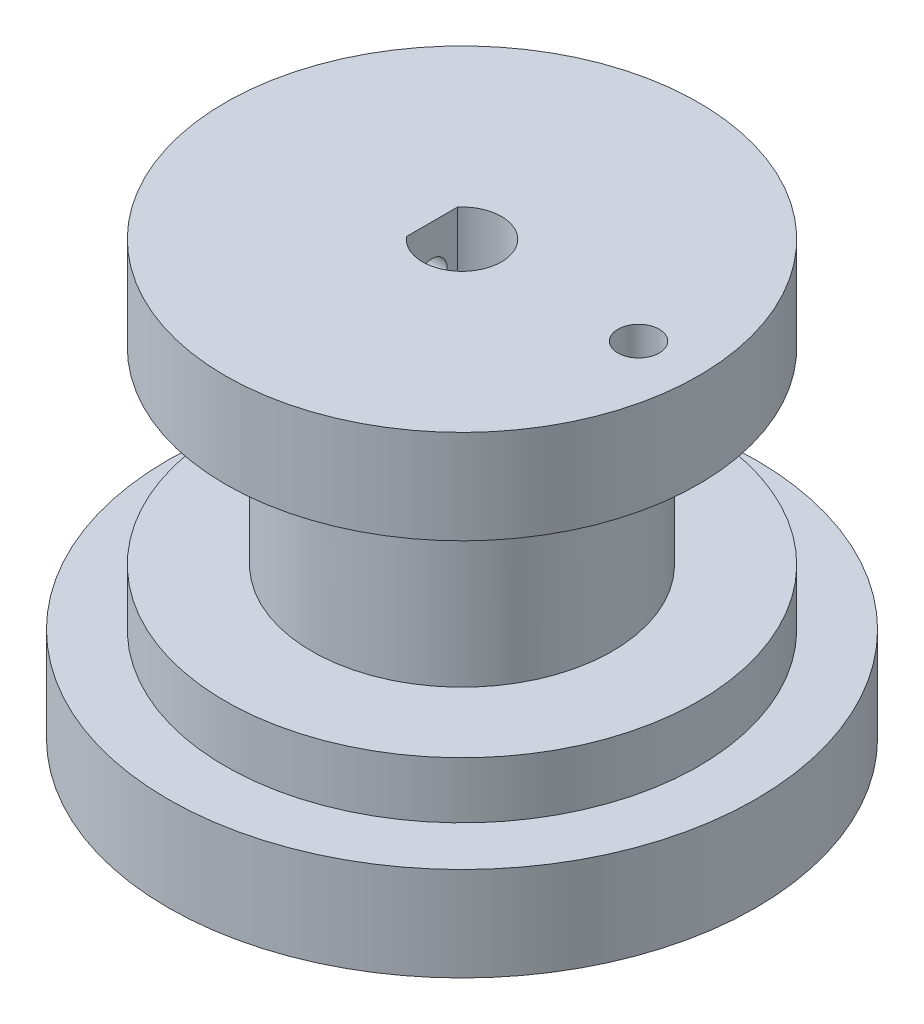
ISO-10303-21;
HEADER;
FILE_DESCRIPTION(('STEP AP214'),'2;1');
FILE_NAME('part.step','',(''),(''),'','','');
FILE_SCHEMA(('AUTOMOTIVE_DESIGN { 1 0 10303 214 1 1 1 1 }'));
ENDSEC;
DATA;
#1=APPLICATION_CONTEXT('core data for automotive mechanical design processes');
#2=APPLICATION_PROTOCOL_DEFINITION('international standard','automotive_design',2000,#1);
#3=PRODUCT_CONTEXT('',#1,'mechanical');
#4=PRODUCT('Part','Part','',(#3));
#5=PRODUCT_RELATED_PRODUCT_CATEGORY('part','',(#4));
#6=PRODUCT_DEFINITION_FORMATION('','',#4);
#7=PRODUCT_DEFINITION_CONTEXT('part definition',#1,'design');
#8=PRODUCT_DEFINITION('design','',#6,#7);
#9=PRODUCT_DEFINITION_SHAPE('','',#8);
#10=(LENGTH_UNIT() NAMED_UNIT(*) SI_UNIT(.MILLI.,.METRE.));
#11=(NAMED_UNIT(*) PLANE_ANGLE_UNIT() SI_UNIT($,.RADIAN.));
#12=(NAMED_UNIT(*) SI_UNIT($,.STERADIAN.) SOLID_ANGLE_UNIT());
#13=UNCERTAINTY_MEASURE_WITH_UNIT(LENGTH_MEASURE(1.E-05),#10,'distance_accuracy_value','');
#14=(GEOMETRIC_REPRESENTATION_CONTEXT(3) GLOBAL_UNCERTAINTY_ASSIGNED_CONTEXT((#13)) GLOBAL_UNIT_ASSIGNED_CONTEXT((#10,
#11,#12)) REPRESENTATION_CONTEXT('',''));
#15=CARTESIAN_POINT('',(0.,0.,0.));
#16=DIRECTION('',(0.,0.,1.));
#17=DIRECTION('',(1.,0.,0.));
#18=AXIS2_PLACEMENT_3D('',#15,#16,#17);
#19=CARTESIAN_POINT('',(0.,-3.,0.));
#20=DIRECTION('',(0.,1.,0.));
#21=DIRECTION('',(0.,0.,1.));
#22=AXIS2_PLACEMENT_3D('',#19,#20,#21);
#23=CYLINDRICAL_SURFACE('',#22,2.1);
#24=CARTESIAN_POINT('',(1.94164878389476,12.5,0.799999999999996));
#25=CARTESIAN_POINT('',(1.94164699833232,12.4568528835088,0.800001879676993));
#26=CARTESIAN_POINT('',(1.943102585536,12.4137179114915,0.796497800571623));
#27=CARTESIAN_POINT('',(1.94872498911232,12.3287517724577,0.782640615272448));
#28=CARTESIAN_POINT('',(1.95289165787973,12.2869205345892,0.772287881954125));
#29=CARTESIAN_POINT('',(1.96339719673269,12.2058138710265,0.745171053432956));
#30=CARTESIAN_POINT('',(1.96973070797949,12.1665324218897,0.728422763384062));
#31=CARTESIAN_POINT('',(1.98384753765178,12.0913214029018,0.689046479794834));
#32=CARTESIAN_POINT('',(1.99163130579252,12.0553928779717,0.666416661568793));
#33=CARTESIAN_POINT('',(2.00821915402083,11.98606332986,0.614675716816078));
#34=CARTESIAN_POINT('',(2.01705390186838,11.9528585916092,0.585311344720344));
#35=CARTESIAN_POINT('',(2.03449287955212,11.891705853021,0.521471686232205));
#36=CARTESIAN_POINT('',(2.043097057807,11.8637590206614,0.486995267296852));
#37=CARTESIAN_POINT('',(2.05947144728356,11.8129612964966,0.412411896008606));
#38=CARTESIAN_POINT('',(2.06720153272778,11.7903249447949,0.372149223837869));
#39=CARTESIAN_POINT('',(2.08058697282075,11.7522288348971,0.288040534021781));
#40=CARTESIAN_POINT('',(2.08624307172665,11.7367665017505,0.2441958087286));
#41=CARTESIAN_POINT('',(2.09462544941136,11.7141493159712,0.156232019338102));
#42=CARTESIAN_POINT('',(2.09747059791007,11.7066562760945,0.112211459631675));
#43=CARTESIAN_POINT('',(2.10033781339492,11.6991055179366,0.0234518871629957));
#44=CARTESIAN_POINT('',(2.10036082775177,11.6990453045075,-0.0212868794582319));
#45=CARTESIAN_POINT('',(2.09765602702878,11.7061676612724,-0.107784143640846));
#46=CARTESIAN_POINT('',(2.09506852951834,11.7129807819771,-0.149578220316622));
#47=CARTESIAN_POINT('',(2.08761866536252,11.7330333204045,-0.231378247119249));
#48=CARTESIAN_POINT('',(2.08275613708709,11.7462731947199,-0.27138406997795));
#49=CARTESIAN_POINT('',(2.07114701454641,11.7789687169565,-0.349171310099706));
#50=CARTESIAN_POINT('',(2.06437377475487,11.7985128774184,-0.386911382765753));
#51=CARTESIAN_POINT('',(2.04962556202786,11.8431828332164,-0.458670936332288));
#52=CARTESIAN_POINT('',(2.04165019517148,11.8683104594639,-0.492689191313412));
#53=CARTESIAN_POINT('',(2.02475018723996,11.9252010489249,-0.558211333544711));
#54=CARTESIAN_POINT('',(2.01579730286622,11.9572723829803,-0.589440595999129));
#55=CARTESIAN_POINT('',(1.99833198884494,12.0262464467357,-0.646183145581933));
#56=CARTESIAN_POINT('',(1.98981967768813,12.063150466847,-0.671694901085843));
#57=CARTESIAN_POINT('',(1.97401796644548,12.1418592672077,-0.716826447599144));
#58=CARTESIAN_POINT('',(1.96676207728876,12.1837589746452,-0.736293375791852));
#59=CARTESIAN_POINT('',(1.95468325573982,12.2705914131839,-0.767789901155166));
#60=CARTESIAN_POINT('',(1.94985891756766,12.3155223747148,-0.779823796578322));
#61=CARTESIAN_POINT('',(1.94352325966061,12.4044214134719,-0.795477889021222));
#62=CARTESIAN_POINT('',(1.94183987737875,12.4483000497857,-0.799535752001992));
#63=CARTESIAN_POINT('',(1.94148888784802,12.5361339678134,-0.800388527707571));
#64=CARTESIAN_POINT('',(1.94282049167064,12.58008922647,-0.797185340424152));
#65=CARTESIAN_POINT('',(1.94817424966198,12.6645415589041,-0.784004187720394));
#66=CARTESIAN_POINT('',(1.95205964461256,12.7051020114608,-0.77437021196188));
#67=CARTESIAN_POINT('',(1.96191925706139,12.7840102881224,-0.749036877022603));
#68=CARTESIAN_POINT('',(1.96789391075156,12.8223576482323,-0.733336251184918));
#69=CARTESIAN_POINT('',(1.98153961091593,12.8973834280495,-0.695640759693074));
#70=CARTESIAN_POINT('',(1.98926680183781,12.9339419109723,-0.6734281156417));
#71=CARTESIAN_POINT('',(2.00545463530356,13.0029675627987,-0.623568661115858));
#72=CARTESIAN_POINT('',(2.01391555295258,13.0354331858236,-0.595919807409689));
#73=CARTESIAN_POINT('',(2.03129012235739,13.0975684524615,-0.533821318323035));
#74=CARTESIAN_POINT('',(2.04019693420108,13.1269135873142,-0.499043915025411));
#75=CARTESIAN_POINT('',(2.05692848722272,13.179392930666,-0.424840970167738));
#76=CARTESIAN_POINT('',(2.0647532163384,13.2025270699321,-0.385415376802109));
#77=CARTESIAN_POINT('',(2.07843990921626,13.2417891255059,-0.303025433897907));
#78=CARTESIAN_POINT('',(2.08430729454874,13.2579364319007,-0.260071276845807));
#79=CARTESIAN_POINT('',(2.09343177638947,13.2826815423713,-0.171780850262254));
#80=CARTESIAN_POINT('',(2.09669014383056,13.2912830224466,-0.126445752043481));
#81=CARTESIAN_POINT('',(2.10010547292817,13.3002865217048,-0.0376087457697565));
#82=CARTESIAN_POINT('',(2.1004366010832,13.3011490467982,0.00584019692997421));
#83=CARTESIAN_POINT('',(2.09841807377082,13.2958420553929,0.092238443322026));
#84=CARTESIAN_POINT('',(2.09606875934191,13.2896734334825,0.135187809874213));
#85=CARTESIAN_POINT('',(2.08903465293787,13.2708042777742,0.218238969958015));
#86=CARTESIAN_POINT('',(2.08441171856163,13.2582764806828,0.258385651936228));
#87=CARTESIAN_POINT('',(2.07331554914458,13.2272187338003,0.336008130101743));
#88=CARTESIAN_POINT('',(2.06684196367384,13.2086876471681,0.373483418766886));
#89=CARTESIAN_POINT('',(2.05234621584812,13.1652526467488,0.446450252468192));
#90=CARTESIAN_POINT('',(2.04426980905919,13.1401107691015,0.481789161589949));
#91=CARTESIAN_POINT('',(2.02755618362467,13.0845389416988,0.547887043256404));
#92=CARTESIAN_POINT('',(2.01891876305954,13.0541070812979,0.578644353531804));
#93=CARTESIAN_POINT('',(2.00147403800879,12.9868353116251,0.636445947730195));
#94=CARTESIAN_POINT('',(1.99268342203299,12.9497353938726,0.663193848854155));
#95=CARTESIAN_POINT('',(1.97645805353686,12.8712908244736,0.71009270130017));
#96=CARTESIAN_POINT('',(1.96902352688579,12.829945467499,0.73024255409963));
#97=CARTESIAN_POINT('',(1.95610827755072,12.7416006329311,0.764194394637584));
#98=CARTESIAN_POINT('',(1.95076481041695,12.6944126359728,0.777563737293924));
#99=CARTESIAN_POINT('',(1.94353732698568,12.5981435966703,0.795462281613972));
#100=CARTESIAN_POINT('',(1.9416508143141,12.5490639465191,0.79999786256002));
#101=CARTESIAN_POINT('',(1.94164878389476,12.5,0.799999999999996));
#102=B_SPLINE_CURVE_WITH_KNOTS('',3,(#24,#25,#26,#27,#28,#29,#30,#31,#32,#33,#34,#35,#36,#37,
#38,#39,#40,#41,#42,#43,#44,#45,#46,#47,#48,#49,#50,#51,#52,#53,#54,#55,#56,#57,#58,#59,#60,#61,
#62,#63,#64,#65,#66,#67,#68,#69,#70,#71,#72,#73,#74,#75,#76,#77,#78,#79,#80,#81,#82,#83,#84,#85,
#86,#87,#88,#89,#90,#91,#92,#93,#94,#95,#96,#97,#98,#99,#100,#101),.UNSPECIFIED.,.T.,.F.,(4,2,2,
2,2,2,2,2,2,2,2,2,2,2,2,2,2,2,2,2,2,2,2,2,2,2,2,2,2,2,2,2,2,2,2,2,2,2,4),(0.,0.129258500703974,
0.258509964498515,0.387444058659251,0.516418201189574,0.651413121766207,0.786437994457466,
0.92622598112136,1.06596375518199,1.19950086087028,1.33299313896266,1.4596731762274,
1.58636221486972,1.71491361875927,1.8435072391664,1.97984173526445,2.11621270955457,
2.25579441609692,2.39529533186353,2.52690045746935,2.6584711500687,2.78351444646914,
2.90858386480088,3.03843705875382,3.1683391524232,3.30678823146984,3.4452388537221,
3.58330273965311,3.72129932943452,3.85102568084781,3.9807355287376,4.10709683087302,
4.2334820760112,4.36525425649951,4.49707412997096,4.6361278430188,4.77520469564702,
4.92229487240554,5.06927878886189),.UNSPECIFIED.);
#103=CARTESIAN_POINT('',(1.94164878389476,12.5,0.799999999999996));
#104=VERTEX_POINT('',#103);
#105=EDGE_CURVE('E74',#104,#104,#102,.T.);
#106=ORIENTED_EDGE('',*,*,#105,.T.);
#107=EDGE_LOOP('',(#106));
#108=FACE_BOUND('',#107,.T.);
#109=DIRECTION('',(0.,1.,0.));
#110=VECTOR('',#109,1.);
#111=CARTESIAN_POINT('',(-1.6,-3.,1.36014705087355));
#112=LINE('',#111,#110);
#113=CARTESIAN_POINT('',(-1.6,15.,1.36014705087355));
#114=VERTEX_POINT('',#113);
#115=CARTESIAN_POINT('',(-1.6,7.,1.36014705087355));
#116=VERTEX_POINT('',#115);
#117=EDGE_CURVE('E11',#114,#116,#112,.F.);
#118=ORIENTED_EDGE('',*,*,#117,.F.);
#119=CARTESIAN_POINT('',(0.,15.,0.));
#120=DIRECTION('',(0.,1.,0.));
#121=DIRECTION('',(0.,0.,1.));
#122=AXIS2_PLACEMENT_3D('',#119,#120,#121);
#123=CIRCLE('',#122,2.1);
#124=CARTESIAN_POINT('',(-1.6,15.,-1.36014705087354));
#125=VERTEX_POINT('',#124);
#126=EDGE_CURVE('E158',#114,#125,#123,.T.);
#127=ORIENTED_EDGE('',*,*,#126,.T.);
#128=DIRECTION('',(0.,1.,0.));
#129=VECTOR('',#128,1.);
#130=CARTESIAN_POINT('',(-1.6,-3.,-1.36014705087354));
#131=LINE('',#130,#129);
#132=CARTESIAN_POINT('',(-1.6,7.,-1.36014705087354));
#133=VERTEX_POINT('',#132);
#134=EDGE_CURVE('E44',#133,#125,#131,.T.);
#135=ORIENTED_EDGE('',*,*,#134,.F.);
#136=CARTESIAN_POINT('',(0.,7.,0.));
#137=DIRECTION('',(0.,-1.,0.));
#138=DIRECTION('',(0.,0.,-1.));
#139=AXIS2_PLACEMENT_3D('',#136,#137,#138);
#140=CIRCLE('',#139,2.1);
#141=EDGE_CURVE('E52',#133,#116,#140,.F.);
#142=ORIENTED_EDGE('',*,*,#141,.T.);
#143=EDGE_LOOP('',(#118,#127,#135,#142));
#144=FACE_BOUND('',#143,.T.);
#145=CARTESIAN_POINT('',(0.,-8.,0.));
#146=DIRECTION('',(0.,-1.,0.));
#147=DIRECTION('',(0.,0.,-1.));
#148=AXIS2_PLACEMENT_3D('',#145,#146,#147);
#149=CIRCLE('',#148,2.1);
#150=CARTESIAN_POINT('',(0.,-8.,-2.1));
#151=VERTEX_POINT('',#150);
#152=EDGE_CURVE('E308',#151,#151,#149,.T.);
#153=ORIENTED_EDGE('',*,*,#152,.T.);
#154=EDGE_LOOP('',(#153));
#155=FACE_BOUND('',#154,.T.);
#156=ADVANCED_FACE('F35',(#108,#144,#155),#23,.F.);
#157=CARTESIAN_POINT('',(0.,10.,0.));
#158=DIRECTION('',(0.,-1.,0.));
#159=DIRECTION('',(0.,0.,-1.));
#160=AXIS2_PLACEMENT_3D('',#157,#158,#159);
#161=CYLINDRICAL_SURFACE('',#160,8.);
#162=CARTESIAN_POINT('',(0.,10.,0.));
#163=DIRECTION('',(0.,1.,0.));
#164=DIRECTION('',(0.,0.,1.));
#165=AXIS2_PLACEMENT_3D('',#162,#163,#164);
#166=CIRCLE('',#165,8.);
#167=CARTESIAN_POINT('',(0.,10.,8.));
#168=VERTEX_POINT('',#167);
#169=EDGE_CURVE('E140',#168,#168,#166,.T.);
#170=ORIENTED_EDGE('',*,*,#169,.F.);
#171=EDGE_LOOP('',(#170));
#172=FACE_BOUND('',#171,.T.);
#173=CARTESIAN_POINT('',(0.,0.,0.));
#174=DIRECTION('',(0.,-1.,0.));
#175=DIRECTION('',(0.,0.,-1.));
#176=AXIS2_PLACEMENT_3D('',#173,#174,#175);
#177=CIRCLE('',#176,8.);
#178=CARTESIAN_POINT('',(0.,0.,-8.));
#179=VERTEX_POINT('',#178);
#180=EDGE_CURVE('E142',#179,#179,#177,.T.);
#181=ORIENTED_EDGE('',*,*,#180,.F.);
#182=EDGE_LOOP('',(#181));
#183=FACE_BOUND('',#182,.T.);
#184=ADVANCED_FACE('F37',(#172,#183),#161,.T.);
#185=CARTESIAN_POINT('',(0.,0.,0.));
#186=DIRECTION('',(0.,-1.,0.));
#187=DIRECTION('',(0.,0.,-1.));
#188=AXIS2_PLACEMENT_3D('',#185,#186,#187);
#189=PLANE('',#188);
#190=CARTESIAN_POINT('',(-9.4,0.,0.));
#191=DIRECTION('',(0.,1.,0.));
#192=DIRECTION('',(0.,0.,1.));
#193=AXIS2_PLACEMENT_3D('',#190,#191,#192);
#194=CIRCLE('',#193,1.1);
#195=CARTESIAN_POINT('',(-9.4,0.,1.1));
#196=VERTEX_POINT('',#195);
#197=EDGE_CURVE('E315',#196,#196,#194,.T.);
#198=ORIENTED_EDGE('',*,*,#197,.F.);
#199=EDGE_LOOP('',(#198));
#200=FACE_BOUND('',#199,.T.);
#201=CARTESIAN_POINT('',(0.,0.,0.));
#202=DIRECTION('',(0.,-1.,0.));
#203=DIRECTION('',(0.,0.,-1.));
#204=AXIS2_PLACEMENT_3D('',#201,#202,#203);
#205=CIRCLE('',#204,12.6);
#206=CARTESIAN_POINT('',(0.,0.,-12.6));
#207=VERTEX_POINT('',#206);
#208=EDGE_CURVE('E166',#207,#207,#205,.T.);
#209=ORIENTED_EDGE('',*,*,#208,.F.);
#210=EDGE_LOOP('',(#209));
#211=FACE_BOUND('',#210,.T.);
#212=ORIENTED_EDGE('',*,*,#180,.T.);
#213=EDGE_LOOP('',(#212));
#214=FACE_BOUND('',#213,.T.);
#215=ADVANCED_FACE('F128',(#200,#211,#214),#189,.F.);
#216=CARTESIAN_POINT('',(0.,-3.,0.));
#217=DIRECTION('',(0.,1.,0.));
#218=DIRECTION('',(0.,0.,1.));
#219=AXIS2_PLACEMENT_3D('',#216,#217,#218);
#220=CYLINDRICAL_SURFACE('',#219,12.6);
#221=CARTESIAN_POINT('',(0.,-3.,0.));
#222=DIRECTION('',(0.,-1.,0.));
#223=DIRECTION('',(0.,0.,-1.));
#224=AXIS2_PLACEMENT_3D('',#221,#222,#223);
#225=CIRCLE('',#224,12.6);
#226=CARTESIAN_POINT('',(0.,-3.,-12.6));
#227=VERTEX_POINT('',#226);
#228=EDGE_CURVE('E146',#227,#227,#225,.T.);
#229=ORIENTED_EDGE('',*,*,#228,.F.);
#230=EDGE_LOOP('',(#229));
#231=FACE_BOUND('',#230,.T.);
#232=ORIENTED_EDGE('',*,*,#208,.T.);
#233=EDGE_LOOP('',(#232));
#234=FACE_BOUND('',#233,.T.);
#235=ADVANCED_FACE('F121',(#231,#234),#220,.T.);
#236=CARTESIAN_POINT('',(0.,10.,0.));
#237=DIRECTION('',(0.,1.,0.));
#238=DIRECTION('',(0.,0.,1.));
#239=AXIS2_PLACEMENT_3D('',#236,#237,#238);
#240=PLANE('',#239);
#241=CARTESIAN_POINT('',(9.4,10.,0.));
#242=DIRECTION('',(0.,-1.,0.));
#243=DIRECTION('',(0.,0.,-1.));
#244=AXIS2_PLACEMENT_3D('',#241,#242,#243);
#245=CIRCLE('',#244,1.1);
#246=CARTESIAN_POINT('',(9.4,10.,-1.1));
#247=VERTEX_POINT('',#246);
#248=EDGE_CURVE('E133',#247,#247,#245,.T.);
#249=ORIENTED_EDGE('',*,*,#248,.F.);
#250=EDGE_LOOP('',(#249));
#251=FACE_BOUND('',#250,.T.);
#252=CARTESIAN_POINT('',(0.,10.,0.));
#253=DIRECTION('',(0.,1.,0.));
#254=DIRECTION('',(0.,0.,1.));
#255=AXIS2_PLACEMENT_3D('',#252,#253,#254);
#256=CIRCLE('',#255,12.6);
#257=CARTESIAN_POINT('',(0.,10.,12.6));
#258=VERTEX_POINT('',#257);
#259=EDGE_CURVE('E137',#258,#258,#256,.T.);
#260=ORIENTED_EDGE('',*,*,#259,.F.);
#261=EDGE_LOOP('',(#260));
#262=FACE_BOUND('',#261,.T.);
#263=ORIENTED_EDGE('',*,*,#169,.T.);
#264=EDGE_LOOP('',(#263));
#265=FACE_BOUND('',#264,.T.);
#266=ADVANCED_FACE('F119',(#251,#262,#265),#240,.F.);
#267=CARTESIAN_POINT('',(0.,15.,0.));
#268=DIRECTION('',(0.,-1.,0.));
#269=DIRECTION('',(0.,0.,-1.));
#270=AXIS2_PLACEMENT_3D('',#267,#268,#269);
#271=CYLINDRICAL_SURFACE('',#270,12.6);
#272=CARTESIAN_POINT('',(-12.5745775276945,12.5,0.799999999999996));
#273=CARTESIAN_POINT('',(-12.5745778676616,12.455112266047,0.799998025396599));
#274=CARTESIAN_POINT('',(-12.5748204675907,12.4101931374248,0.796209350013812));
#275=CARTESIAN_POINT('',(-12.5757647630131,12.3215953129864,0.781150016896046));
#276=CARTESIAN_POINT('',(-12.5764669922779,12.2779181210532,0.76987065994321));
#277=CARTESIAN_POINT('',(-12.5782506859119,12.1931003390021,0.740155343764789));
#278=CARTESIAN_POINT('',(-12.5793319494619,12.1519584191977,0.721723173673076));
#279=CARTESIAN_POINT('',(-12.5817516243511,12.0733631913841,0.678231608778452));
#280=CARTESIAN_POINT('',(-12.5830899769504,12.0359090437424,0.653173727329384));
#281=CARTESIAN_POINT('',(-12.5858753704345,11.9656838918634,0.597099577675161));
#282=CARTESIAN_POINT('',(-12.5873225571524,11.9329193484085,0.566075224799364));
#283=CARTESIAN_POINT('',(-12.5901611982671,11.8730587704134,0.498965500842068));
#284=CARTESIAN_POINT('',(-12.591552650333,11.8459629727621,0.46287991836399));
#285=CARTESIAN_POINT('',(-12.5941242968862,11.7981892136247,0.386635653965054));
#286=CARTESIAN_POINT('',(-12.5953043153204,11.7775165900635,0.34647362091643));
#287=CARTESIAN_POINT('',(-12.5973185987744,11.743210179145,0.263240007490224));
#288=CARTESIAN_POINT('',(-12.5981528675916,11.7295763144815,0.220168459073481));
#289=CARTESIAN_POINT('',(-12.5993806435381,11.7097523421854,0.132400628992771));
#290=CARTESIAN_POINT('',(-12.5997747491017,11.7035521271143,0.087706638782187));
#291=CARTESIAN_POINT('',(-12.6000798075576,11.6987402410679,-0.00208933193220635));
#292=CARTESIAN_POINT('',(-12.5999907660417,11.7001284822661,-0.0471913077080854));
#293=CARTESIAN_POINT('',(-12.5993400627321,11.7104457661604,-0.136454504443628));
#294=CARTESIAN_POINT('',(-12.5987790823929,11.7193639361088,-0.180616987761234));
#295=CARTESIAN_POINT('',(-12.5972484408361,11.7444710496239,-0.266816860915179));
#296=CARTESIAN_POINT('',(-12.5962787771407,11.7606600372704,-0.30885423786623));
#297=CARTESIAN_POINT('',(-12.5940387699117,11.7998615437176,-0.389645498911937));
#298=CARTESIAN_POINT('',(-12.5927682094952,11.8228789874271,-0.428396987087632));
#299=CARTESIAN_POINT('',(-12.5900693917045,11.8750804420153,-0.501490292437836));
#300=CARTESIAN_POINT('',(-12.5886411324972,11.9042645245826,-0.535832058340821));
#301=CARTESIAN_POINT('',(-12.5857846725911,11.968032229688,-0.599194547401847));
#302=CARTESIAN_POINT('',(-12.5843564764433,12.0026252898575,-0.628205773624091));
#303=CARTESIAN_POINT('',(-12.5816636769654,12.0761959219618,-0.680010431827407));
#304=CARTESIAN_POINT('',(-12.5803990737025,12.1151734957018,-0.702803861248721));
#305=CARTESIAN_POINT('',(-12.5781762724374,12.1964127862675,-0.741525240040239));
#306=CARTESIAN_POINT('',(-12.577218092459,12.2386746960968,-0.757452785577085));
#307=CARTESIAN_POINT('',(-12.5757168322069,12.3252802128082,-0.781983695260393));
#308=CARTESIAN_POINT('',(-12.5751737468929,12.3696237944068,-0.790587148338802));
#309=CARTESIAN_POINT('',(-12.5745648660774,12.4590510512592,-0.800213812688113));
#310=CARTESIAN_POINT('',(-12.5744982392562,12.5041332998287,-0.801250226917022));
#311=CARTESIAN_POINT('',(-12.5748476171867,12.5938309979455,-0.79574789342056));
#312=CARTESIAN_POINT('',(-12.5752636193456,12.6384464499993,-0.789209186391174));
#313=CARTESIAN_POINT('',(-12.5765306156057,12.7259067257624,-0.768753189475533));
#314=CARTESIAN_POINT('',(-12.5773812510153,12.768752978082,-0.75484198356948));
#315=CARTESIAN_POINT('',(-12.579421350218,12.8515027069879,-0.720042040731856));
#316=CARTESIAN_POINT('',(-12.5806108171821,12.8914061560285,-0.699153238497632));
#317=CARTESIAN_POINT('',(-12.5831965544337,12.9671982025928,-0.65095733446248));
#318=CARTESIAN_POINT('',(-12.5845931087147,13.0030811659912,-0.62364138799277));
#319=CARTESIAN_POINT('',(-12.5874346502637,13.0697568913388,-0.563379463865039));
#320=CARTESIAN_POINT('',(-12.5888796380205,13.1005496018946,-0.530433429370034));
#321=CARTESIAN_POINT('',(-12.5916576501868,13.1562153447493,-0.459789713623408));
#322=CARTESIAN_POINT('',(-12.5929905112032,13.1810798318281,-0.422085291622804));
#323=CARTESIAN_POINT('',(-12.5953917344913,13.2241248345849,-0.343028977941923));
#324=CARTESIAN_POINT('',(-12.5964600984366,13.2423053925584,-0.301677109344544));
#325=CARTESIAN_POINT('',(-12.5982111683517,13.2714516022804,-0.216531113038256));
#326=CARTESIAN_POINT('',(-12.5988941630815,13.2824226571809,-0.172738841050264));
#327=CARTESIAN_POINT('',(-12.5997986886995,13.296856114379,-0.0839293527350103));
#328=CARTESIAN_POINT('',(-12.6000202243002,13.3003185933539,-0.038912148921453));
#329=CARTESIAN_POINT('',(-12.5999768839911,13.2996358616783,0.0509847613316326));
#330=CARTESIAN_POINT('',(-12.5997128629791,13.2955040220101,0.0958645703428007));
#331=CARTESIAN_POINT('',(-12.5987297954377,13.2797776700802,0.184291797718513));
#332=CARTESIAN_POINT('',(-12.5980107481143,13.2681831447957,0.227839213757826));
#333=CARTESIAN_POINT('',(-12.596198442469,13.2378635805416,0.312367469929137));
#334=CARTESIAN_POINT('',(-12.5951051873938,13.2191386034347,0.353348332324548));
#335=CARTESIAN_POINT('',(-12.5926671955715,13.1750915121255,0.431586304996333));
#336=CARTESIAN_POINT('',(-12.591322465242,13.1497695662699,0.468843510262366));
#337=CARTESIAN_POINT('',(-12.588529958599,13.093197883508,0.538644417474442));
#338=CARTESIAN_POINT('',(-12.5870820165115,13.0619384696982,0.571180269680287));
#339=CARTESIAN_POINT('',(-12.5842476043713,12.9943923883311,0.630553943173488));
#340=CARTESIAN_POINT('',(-12.5828611494427,12.9581044928627,0.657390368644782));
#341=CARTESIAN_POINT('',(-12.5803047290693,12.8814888785224,0.704623939700161));
#342=CARTESIAN_POINT('',(-12.5791350400515,12.8411561010765,0.725012886322638));
#343=CARTESIAN_POINT('',(-12.5771481234325,12.7576615664971,0.758704542604477));
#344=CARTESIAN_POINT('',(-12.5763304835414,12.7145031871158,0.77201554566784));
#345=CARTESIAN_POINT('',(-12.5753543624983,12.6425676178873,0.78771665517149));
#346=CARTESIAN_POINT('',(-12.5750643527478,12.6142553316013,0.792316946178813));
#347=CARTESIAN_POINT('',(-12.5746758269669,12.5572996282038,0.798459246679965));
#348=CARTESIAN_POINT('',(-12.5745773106604,12.5286562115696,0.800001260581623));
#349=CARTESIAN_POINT('',(-12.5745775276945,12.5,0.799999999999996));
#350=B_SPLINE_CURVE_WITH_KNOTS('',3,(#272,#273,#274,#275,#276,#277,#278,#279,#280,#281,#282,
#283,#284,#285,#286,#287,#288,#289,#290,#291,#292,#293,#294,#295,#296,#297,#298,#299,#300,#301,
#302,#303,#304,#305,#306,#307,#308,#309,#310,#311,#312,#313,#314,#315,#316,#317,#318,#319,#320,
#321,#322,#323,#324,#325,#326,#327,#328,#329,#330,#331,#332,#333,#334,#335,#336,#337,#338,#339,
#340,#341,#342,#343,#344,#345,#346,#347,#348,#349),.UNSPECIFIED.,.T.,.F.,(4,2,2,2,2,2,2,2,2,2,2,
2,2,2,2,2,2,2,2,2,2,2,2,2,2,2,2,2,2,2,2,2,2,2,2,2,2,2,4),(0.,0.134558588160676,
0.269273718317808,0.403917581637043,0.538530717982756,0.673327559234391,0.808130032335182,
0.943044234108146,1.07795695409815,1.21268602619238,1.34741353897719,1.48194684566302,
1.61648096797521,1.75111235763197,1.88574531249652,2.02061585279325,2.15548644861373,
2.29036497608837,2.42524186579268,2.55988336613857,2.69452414315043,2.82905398366353,
2.96358508326373,3.0983024109998,3.23302109881745,3.36793281807798,3.50284368360975,
3.63765332471821,3.77246158915005,3.90703272993845,4.04160410556096,4.17617431369056,
4.3107410880876,4.44552909149577,4.58035006714226,4.71534180531025,4.85017501976685,
4.93607699317385,5.02197884277209),.UNSPECIFIED.);
#351=CARTESIAN_POINT('',(-12.5745775276945,12.5,0.799999999999996));
#352=VERTEX_POINT('',#351);
#353=EDGE_CURVE('E78',#352,#352,#350,.T.);
#354=ORIENTED_EDGE('',*,*,#353,.T.);
#355=EDGE_LOOP('',(#354));
#356=FACE_BOUND('',#355,.T.);
#357=CARTESIAN_POINT('',(0.,15.,0.));
#358=DIRECTION('',(0.,1.,0.));
#359=DIRECTION('',(0.,0.,1.));
#360=AXIS2_PLACEMENT_3D('',#357,#358,#359);
#361=CIRCLE('',#360,12.6);
#362=CARTESIAN_POINT('',(0.,15.,12.6));
#363=VERTEX_POINT('',#362);
#364=EDGE_CURVE('E163',#363,#363,#361,.T.);
#365=ORIENTED_EDGE('',*,*,#364,.F.);
#366=EDGE_LOOP('',(#365));
#367=FACE_BOUND('',#366,.T.);
#368=ORIENTED_EDGE('',*,*,#259,.T.);
#369=EDGE_LOOP('',(#368));
#370=FACE_BOUND('',#369,.T.);
#371=ADVANCED_FACE('F92',(#356,#367,#370),#271,.T.);
#372=CARTESIAN_POINT('',(0.,15.,0.));
#373=DIRECTION('',(0.,1.,0.));
#374=DIRECTION('',(0.,0.,1.));
#375=AXIS2_PLACEMENT_3D('',#372,#373,#374);
#376=PLANE('',#375);
#377=CARTESIAN_POINT('',(9.4,15.,0.));
#378=DIRECTION('',(0.,1.,0.));
#379=DIRECTION('',(0.,0.,1.));
#380=AXIS2_PLACEMENT_3D('',#377,#378,#379);
#381=CIRCLE('',#380,1.1);
#382=CARTESIAN_POINT('',(9.4,15.,1.1));
#383=VERTEX_POINT('',#382);
#384=EDGE_CURVE('E39',#383,#383,#381,.T.);
#385=ORIENTED_EDGE('',*,*,#384,.F.);
#386=EDGE_LOOP('',(#385));
#387=FACE_BOUND('',#386,.T.);
#388=DIRECTION('',(0.,0.,1.));
#389=VECTOR('',#388,1.);
#390=CARTESIAN_POINT('',(-1.6,15.,-2.44685641523823));
#391=LINE('',#390,#389);
#392=EDGE_CURVE('E153',#125,#114,#391,.T.);
#393=ORIENTED_EDGE('',*,*,#392,.F.);
#394=ORIENTED_EDGE('',*,*,#126,.F.);
#395=EDGE_LOOP('',(#393,#394));
#396=FACE_BOUND('',#395,.T.);
#397=ORIENTED_EDGE('',*,*,#364,.T.);
#398=EDGE_LOOP('',(#397));
#399=FACE_BOUND('',#398,.T.);
#400=ADVANCED_FACE('F116',(#387,#396,#399),#376,.T.);
#401=CARTESIAN_POINT('',(-1.6,7.,-2.44685641523823));
#402=DIRECTION('',(-1.,0.,0.));
#403=DIRECTION('',(0.,0.,1.));
#404=AXIS2_PLACEMENT_3D('',#401,#402,#403);
#405=PLANE('',#404);
#406=CARTESIAN_POINT('',(-1.6,12.5,0.));
#407=DIRECTION('',(-1.,0.,0.));
#408=DIRECTION('',(0.,0.,1.));
#409=AXIS2_PLACEMENT_3D('',#406,#407,#408);
#410=CIRCLE('',#409,0.799999999999996);
#411=CARTESIAN_POINT('',(-1.6,12.5,0.799999999999996));
#412=VERTEX_POINT('',#411);
#413=EDGE_CURVE('E90',#412,#412,#410,.T.);
#414=ORIENTED_EDGE('',*,*,#413,.T.);
#415=EDGE_LOOP('',(#414));
#416=FACE_BOUND('',#415,.T.);
#417=ORIENTED_EDGE('',*,*,#392,.T.);
#418=ORIENTED_EDGE('',*,*,#117,.T.);
#419=DIRECTION('',(0.,0.,1.));
#420=VECTOR('',#419,1.);
#421=CARTESIAN_POINT('',(-1.6,7.,-2.44685641523823));
#422=LINE('',#421,#420);
#423=EDGE_CURVE('E155',#133,#116,#422,.T.);
#424=ORIENTED_EDGE('',*,*,#423,.F.);
#425=ORIENTED_EDGE('',*,*,#134,.T.);
#426=EDGE_LOOP('',(#417,#418,#424,#425));
#427=FACE_BOUND('',#426,.T.);
#428=ADVANCED_FACE('F115',(#416,#427),#405,.F.);
#429=CARTESIAN_POINT('',(0.,7.,0.));
#430=DIRECTION('',(0.,-1.,0.));
#431=DIRECTION('',(0.,0.,-1.));
#432=AXIS2_PLACEMENT_3D('',#429,#430,#431);
#433=PLANE('',#432);
#434=ORIENTED_EDGE('',*,*,#141,.F.);
#435=ORIENTED_EDGE('',*,*,#423,.T.);
#436=EDGE_LOOP('',(#434,#435));
#437=FACE_BOUND('',#436,.T.);
#438=ADVANCED_FACE('F68',(#437),#433,.T.);
#439=CARTESIAN_POINT('',(3.4,12.5,0.));
#440=DIRECTION('',(-1.,0.,0.));
#441=DIRECTION('',(0.,0.,1.));
#442=AXIS2_PLACEMENT_3D('',#439,#440,#441);
#443=CONICAL_SURFACE('',#442,0.799999999999995,1.02974425867665);
#444=CARTESIAN_POINT('',(3.88068849522205,12.5,0.));
#445=VERTEX_POINT('',#444);
#446=VERTEX_LOOP('',#445);
#447=FACE_BOUND('',#446,.T.);
#448=CARTESIAN_POINT('',(3.4,12.5,0.));
#449=DIRECTION('',(-1.,0.,0.));
#450=DIRECTION('',(0.,0.,1.));
#451=AXIS2_PLACEMENT_3D('',#448,#449,#450);
#452=CIRCLE('',#451,0.799999999999995);
#453=CARTESIAN_POINT('',(3.4,12.5,0.799999999999995));
#454=VERTEX_POINT('',#453);
#455=EDGE_CURVE('E72',#454,#454,#452,.T.);
#456=ORIENTED_EDGE('',*,*,#455,.T.);
#457=EDGE_LOOP('',(#456));
#458=FACE_BOUND('',#457,.T.);
#459=ADVANCED_FACE('F64',(#447,#458),#443,.F.);
#460=CARTESIAN_POINT('',(-12.6,12.5,0.));
#461=DIRECTION('',(-1.,0.,0.));
#462=DIRECTION('',(0.,0.,1.));
#463=AXIS2_PLACEMENT_3D('',#460,#461,#462);
#464=CYLINDRICAL_SURFACE('',#463,0.799999999999996);
#465=ORIENTED_EDGE('',*,*,#455,.F.);
#466=EDGE_LOOP('',(#465));
#467=FACE_BOUND('',#466,.T.);
#468=ORIENTED_EDGE('',*,*,#105,.F.);
#469=EDGE_LOOP('',(#468));
#470=FACE_BOUND('',#469,.T.);
#471=ADVANCED_FACE('F67',(#467,#470),#464,.F.);
#472=ORIENTED_EDGE('',*,*,#353,.F.);
#473=EDGE_LOOP('',(#472));
#474=FACE_BOUND('',#473,.T.);
#475=ORIENTED_EDGE('',*,*,#413,.F.);
#476=EDGE_LOOP('',(#475));
#477=FACE_BOUND('',#476,.T.);
#478=ADVANCED_FACE('F96',(#474,#477),#464,.F.);
#479=CARTESIAN_POINT('',(0.,-8.,0.));
#480=DIRECTION('',(0.,-1.,0.));
#481=DIRECTION('',(0.,0.,-1.));
#482=AXIS2_PLACEMENT_3D('',#479,#480,#481);
#483=PLANE('',#482);
#484=CARTESIAN_POINT('',(-9.4,-8.,0.));
#485=DIRECTION('',(0.,1.,0.));
#486=DIRECTION('',(0.,0.,1.));
#487=AXIS2_PLACEMENT_3D('',#484,#485,#486);
#488=CIRCLE('',#487,1.1);
#489=CARTESIAN_POINT('',(-9.4,-8.,1.1));
#490=VERTEX_POINT('',#489);
#491=EDGE_CURVE('E304',#490,#490,#488,.T.);
#492=ORIENTED_EDGE('',*,*,#491,.T.);
#493=EDGE_LOOP('',(#492));
#494=FACE_BOUND('',#493,.T.);
#495=ORIENTED_EDGE('',*,*,#152,.F.);
#496=EDGE_LOOP('',(#495));
#497=FACE_BOUND('',#496,.T.);
#498=CARTESIAN_POINT('',(0.,-8.,0.));
#499=DIRECTION('',(0.,-1.,0.));
#500=DIRECTION('',(0.,0.,-1.));
#501=AXIS2_PLACEMENT_3D('',#498,#499,#500);
#502=CIRCLE('',#501,15.6440140000327);
#503=CARTESIAN_POINT('',(0.,-8.,-15.6440140000327));
#504=VERTEX_POINT('',#503);
#505=EDGE_CURVE('E75',#504,#504,#502,.T.);
#506=ORIENTED_EDGE('',*,*,#505,.T.);
#507=EDGE_LOOP('',(#506));
#508=FACE_BOUND('',#507,.T.);
#509=ADVANCED_FACE('F100',(#494,#497,#508),#483,.T.);
#510=CARTESIAN_POINT('',(0.,-8.,0.));
#511=DIRECTION('',(0.,1.,0.));
#512=DIRECTION('',(0.,0.,1.));
#513=AXIS2_PLACEMENT_3D('',#510,#511,#512);
#514=CYLINDRICAL_SURFACE('',#513,15.6440140000327);
#515=ORIENTED_EDGE('',*,*,#505,.F.);
#516=EDGE_LOOP('',(#515));
#517=FACE_BOUND('',#516,.T.);
#518=CARTESIAN_POINT('',(0.,-3.,0.));
#519=DIRECTION('',(0.,-1.,0.));
#520=DIRECTION('',(0.,0.,-1.));
#521=AXIS2_PLACEMENT_3D('',#518,#519,#520);
#522=CIRCLE('',#521,15.6440140000327);
#523=CARTESIAN_POINT('',(0.,-3.,-15.6440140000327));
#524=VERTEX_POINT('',#523);
#525=EDGE_CURVE('E80',#524,#524,#522,.T.);
#526=ORIENTED_EDGE('',*,*,#525,.T.);
#527=EDGE_LOOP('',(#526));
#528=FACE_BOUND('',#527,.T.);
#529=ADVANCED_FACE('F102',(#517,#528),#514,.T.);
#530=CARTESIAN_POINT('',(0.,-3.,0.));
#531=DIRECTION('',(0.,-1.,0.));
#532=DIRECTION('',(0.,0.,-1.));
#533=AXIS2_PLACEMENT_3D('',#530,#531,#532);
#534=PLANE('',#533);
#535=ORIENTED_EDGE('',*,*,#525,.F.);
#536=EDGE_LOOP('',(#535));
#537=FACE_BOUND('',#536,.T.);
#538=ORIENTED_EDGE('',*,*,#228,.T.);
#539=EDGE_LOOP('',(#538));
#540=FACE_BOUND('',#539,.T.);
#541=ADVANCED_FACE('F247',(#537,#540),#534,.F.);
#542=CARTESIAN_POINT('',(-9.4,-8.,0.));
#543=DIRECTION('',(0.,1.,0.));
#544=DIRECTION('',(0.,0.,1.));
#545=AXIS2_PLACEMENT_3D('',#542,#543,#544);
#546=CYLINDRICAL_SURFACE('',#545,1.1);
#547=ORIENTED_EDGE('',*,*,#491,.F.);
#548=EDGE_LOOP('',(#547));
#549=FACE_BOUND('',#548,.T.);
#550=ORIENTED_EDGE('',*,*,#197,.T.);
#551=EDGE_LOOP('',(#550));
#552=FACE_BOUND('',#551,.T.);
#553=ADVANCED_FACE('F255',(#549,#552),#546,.F.);
#554=CARTESIAN_POINT('',(9.4,20.,0.));
#555=DIRECTION('',(0.,-1.,0.));
#556=DIRECTION('',(0.,0.,-1.));
#557=AXIS2_PLACEMENT_3D('',#554,#555,#556);
#558=CYLINDRICAL_SURFACE('',#557,1.1);
#559=ORIENTED_EDGE('',*,*,#384,.T.);
#560=EDGE_LOOP('',(#559));
#561=FACE_BOUND('',#560,.T.);
#562=ORIENTED_EDGE('',*,*,#248,.T.);
#563=EDGE_LOOP('',(#562));
#564=FACE_BOUND('',#563,.T.);
#565=ADVANCED_FACE('F273',(#561,#564),#558,.F.);
#566=CLOSED_SHELL('',(#156,#184,#215,#235,#266,#371,#400,#428,#438,#459,#471,#478,#509,#529,
#541,#553,#565));
#567=MANIFOLD_SOLID_BREP('B2',#566);
#568=ADVANCED_BREP_SHAPE_REPRESENTATION('',(#18,#567),#14);
#569=SHAPE_DEFINITION_REPRESENTATION(#9,#568);
ENDSEC;
END-ISO-10303-21;
